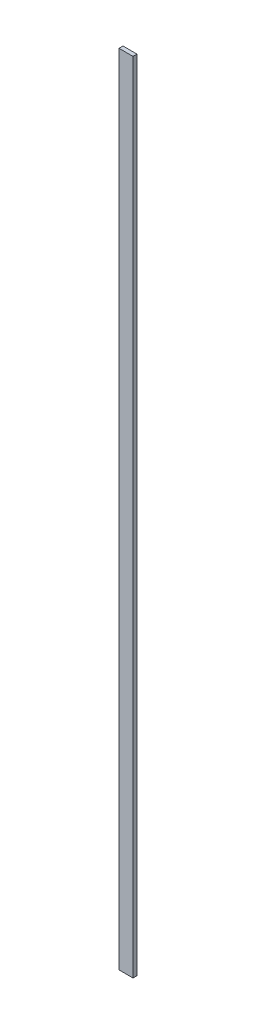
ISO-10303-21;
HEADER;
FILE_DESCRIPTION(('STEP AP214'),'2;1');
FILE_NAME('part.step','',(''),(''),'','','');
FILE_SCHEMA(('AUTOMOTIVE_DESIGN { 1 0 10303 214 1 1 1 1 }'));
ENDSEC;
DATA;
#1=APPLICATION_CONTEXT('core data for automotive mechanical design processes');
#2=APPLICATION_PROTOCOL_DEFINITION('international standard','automotive_design',2000,#1);
#3=PRODUCT_CONTEXT('',#1,'mechanical');
#4=PRODUCT('Part','Part','',(#3));
#5=PRODUCT_RELATED_PRODUCT_CATEGORY('part','',(#4));
#6=PRODUCT_DEFINITION_FORMATION('','',#4);
#7=PRODUCT_DEFINITION_CONTEXT('part definition',#1,'design');
#8=PRODUCT_DEFINITION('design','',#6,#7);
#9=PRODUCT_DEFINITION_SHAPE('','',#8);
#10=(LENGTH_UNIT() NAMED_UNIT(*) SI_UNIT(.MILLI.,.METRE.));
#11=(NAMED_UNIT(*) PLANE_ANGLE_UNIT() SI_UNIT($,.RADIAN.));
#12=(NAMED_UNIT(*) SI_UNIT($,.STERADIAN.) SOLID_ANGLE_UNIT());
#13=UNCERTAINTY_MEASURE_WITH_UNIT(LENGTH_MEASURE(1.E-05),#10,'distance_accuracy_value','');
#14=(GEOMETRIC_REPRESENTATION_CONTEXT(3) GLOBAL_UNCERTAINTY_ASSIGNED_CONTEXT((#13)) GLOBAL_UNIT_ASSIGNED_CONTEXT((#10,
#11,#12)) REPRESENTATION_CONTEXT('',''));
#15=CARTESIAN_POINT('',(0.,0.,0.));
#16=DIRECTION('',(0.,0.,1.));
#17=DIRECTION('',(1.,0.,0.));
#18=AXIS2_PLACEMENT_3D('',#15,#16,#17);
#19=CARTESIAN_POINT('',(-21.7388062871707,33.9181818181818,2.));
#20=DIRECTION('',(1.,0.,0.));
#21=DIRECTION('',(0.,1.,0.));
#22=AXIS2_PLACEMENT_3D('',#19,#20,#21);
#23=PLANE('',#22);
#24=DIRECTION('',(0.,-1.,0.));
#25=VECTOR('',#24,1.);
#26=CARTESIAN_POINT('',(-21.7388062871707,33.9181818181818,0.));
#27=LINE('',#26,#25);
#28=CARTESIAN_POINT('',(-21.7388062871707,33.9181818181818,0.));
#29=VERTEX_POINT('',#28);
#30=CARTESIAN_POINT('',(-21.7388062871707,-366.081818181818,0.));
#31=VERTEX_POINT('',#30);
#32=EDGE_CURVE('E96',#29,#31,#27,.T.);
#33=ORIENTED_EDGE('',*,*,#32,.T.);
#34=DIRECTION('',(0.,0.,-1.));
#35=VECTOR('',#34,1.);
#36=CARTESIAN_POINT('',(-21.7388062871707,-366.081818181818,2.));
#37=LINE('',#36,#35);
#38=CARTESIAN_POINT('',(-21.7388062871707,-366.081818181818,2.));
#39=VERTEX_POINT('',#38);
#40=EDGE_CURVE('E11',#39,#31,#37,.T.);
#41=ORIENTED_EDGE('',*,*,#40,.F.);
#42=DIRECTION('',(0.,-1.,0.));
#43=VECTOR('',#42,1.);
#44=CARTESIAN_POINT('',(-21.7388062871707,33.9181818181818,2.));
#45=LINE('',#44,#43);
#46=CARTESIAN_POINT('',(-21.7388062871707,33.9181818181818,2.));
#47=VERTEX_POINT('',#46);
#48=EDGE_CURVE('E84',#47,#39,#45,.T.);
#49=ORIENTED_EDGE('',*,*,#48,.F.);
#50=DIRECTION('',(0.,0.,-1.));
#51=VECTOR('',#50,1.);
#52=CARTESIAN_POINT('',(-21.7388062871707,33.9181818181818,2.));
#53=LINE('',#52,#51);
#54=EDGE_CURVE('E92',#47,#29,#53,.T.);
#55=ORIENTED_EDGE('',*,*,#54,.T.);
#56=EDGE_LOOP('',(#33,#41,#49,#55));
#57=FACE_BOUND('',#56,.T.);
#58=ADVANCED_FACE('F33',(#57),#23,.F.);
#59=CARTESIAN_POINT('',(-21.7388062871707,-366.081818181818,2.));
#60=DIRECTION('',(0.,1.,0.));
#61=DIRECTION('',(0.,0.,1.));
#62=AXIS2_PLACEMENT_3D('',#59,#60,#61);
#63=PLANE('',#62);
#64=DIRECTION('',(1.,0.,0.));
#65=VECTOR('',#64,1.);
#66=CARTESIAN_POINT('',(-21.7388062871707,-366.081818181818,0.));
#67=LINE('',#66,#65);
#68=CARTESIAN_POINT('',(-14.7388062871707,-366.081818181818,0.));
#69=VERTEX_POINT('',#68);
#70=EDGE_CURVE('E88',#31,#69,#67,.T.);
#71=ORIENTED_EDGE('',*,*,#70,.T.);
#72=DIRECTION('',(0.,0.,-1.));
#73=VECTOR('',#72,1.);
#74=CARTESIAN_POINT('',(-14.7388062871707,-366.081818181818,2.));
#75=LINE('',#74,#73);
#76=CARTESIAN_POINT('',(-14.7388062871707,-366.081818181818,2.));
#77=VERTEX_POINT('',#76);
#78=EDGE_CURVE('E41',#77,#69,#75,.T.);
#79=ORIENTED_EDGE('',*,*,#78,.F.);
#80=DIRECTION('',(1.,0.,0.));
#81=VECTOR('',#80,1.);
#82=CARTESIAN_POINT('',(-21.7388062871707,-366.081818181818,2.));
#83=LINE('',#82,#81);
#84=EDGE_CURVE('E79',#39,#77,#83,.T.);
#85=ORIENTED_EDGE('',*,*,#84,.F.);
#86=ORIENTED_EDGE('',*,*,#40,.T.);
#87=EDGE_LOOP('',(#71,#79,#85,#86));
#88=FACE_BOUND('',#87,.T.);
#89=ADVANCED_FACE('F87',(#88),#63,.F.);
#90=CARTESIAN_POINT('',(-14.7388062871707,33.9181818181818,2.));
#91=DIRECTION('',(-1.,0.,0.));
#92=DIRECTION('',(0.,-1.,0.));
#93=AXIS2_PLACEMENT_3D('',#90,#91,#92);
#94=PLANE('',#93);
#95=DIRECTION('',(0.,1.,0.));
#96=VECTOR('',#95,1.);
#97=CARTESIAN_POINT('',(-14.7388062871707,33.9181818181818,0.));
#98=LINE('',#97,#96);
#99=CARTESIAN_POINT('',(-14.7388062871707,33.9181818181818,0.));
#100=VERTEX_POINT('',#99);
#101=EDGE_CURVE('E66',#69,#100,#98,.T.);
#102=ORIENTED_EDGE('',*,*,#101,.T.);
#103=DIRECTION('',(0.,0.,-1.));
#104=VECTOR('',#103,1.);
#105=CARTESIAN_POINT('',(-14.7388062871707,33.9181818181818,2.));
#106=LINE('',#105,#104);
#107=CARTESIAN_POINT('',(-14.7388062871707,33.9181818181818,2.));
#108=VERTEX_POINT('',#107);
#109=EDGE_CURVE('E89',#108,#100,#106,.T.);
#110=ORIENTED_EDGE('',*,*,#109,.F.);
#111=DIRECTION('',(0.,1.,0.));
#112=VECTOR('',#111,1.);
#113=CARTESIAN_POINT('',(-14.7388062871707,33.9181818181818,2.));
#114=LINE('',#113,#112);
#115=EDGE_CURVE('E82',#77,#108,#114,.T.);
#116=ORIENTED_EDGE('',*,*,#115,.F.);
#117=ORIENTED_EDGE('',*,*,#78,.T.);
#118=EDGE_LOOP('',(#102,#110,#116,#117));
#119=FACE_BOUND('',#118,.T.);
#120=ADVANCED_FACE('F90',(#119),#94,.F.);
#121=CARTESIAN_POINT('',(-21.7388062871707,33.9181818181818,2.));
#122=DIRECTION('',(0.,-1.,0.));
#123=DIRECTION('',(0.,0.,-1.));
#124=AXIS2_PLACEMENT_3D('',#121,#122,#123);
#125=PLANE('',#124);
#126=DIRECTION('',(-1.,0.,0.));
#127=VECTOR('',#126,1.);
#128=CARTESIAN_POINT('',(-21.7388062871707,33.9181818181818,0.));
#129=LINE('',#128,#127);
#130=EDGE_CURVE('E72',#100,#29,#129,.T.);
#131=ORIENTED_EDGE('',*,*,#130,.T.);
#132=ORIENTED_EDGE('',*,*,#54,.F.);
#133=DIRECTION('',(-1.,0.,0.));
#134=VECTOR('',#133,1.);
#135=CARTESIAN_POINT('',(-21.7388062871707,33.9181818181818,2.));
#136=LINE('',#135,#134);
#137=EDGE_CURVE('E49',#108,#47,#136,.T.);
#138=ORIENTED_EDGE('',*,*,#137,.F.);
#139=ORIENTED_EDGE('',*,*,#109,.T.);
#140=EDGE_LOOP('',(#131,#132,#138,#139));
#141=FACE_BOUND('',#140,.T.);
#142=ADVANCED_FACE('F103',(#141),#125,.F.);
#143=CARTESIAN_POINT('',(0.,0.,2.));
#144=DIRECTION('',(0.,0.,1.));
#145=DIRECTION('',(1.,0.,0.));
#146=AXIS2_PLACEMENT_3D('',#143,#144,#145);
#147=PLANE('',#146);
#148=ORIENTED_EDGE('',*,*,#48,.T.);
#149=ORIENTED_EDGE('',*,*,#84,.T.);
#150=ORIENTED_EDGE('',*,*,#115,.T.);
#151=ORIENTED_EDGE('',*,*,#137,.T.);
#152=EDGE_LOOP('',(#148,#149,#150,#151));
#153=FACE_BOUND('',#152,.T.);
#154=ADVANCED_FACE('F80',(#153),#147,.T.);
#155=CARTESIAN_POINT('',(0.,0.,0.));
#156=DIRECTION('',(0.,0.,1.));
#157=DIRECTION('',(1.,0.,0.));
#158=AXIS2_PLACEMENT_3D('',#155,#156,#157);
#159=PLANE('',#158);
#160=ORIENTED_EDGE('',*,*,#32,.F.);
#161=ORIENTED_EDGE('',*,*,#130,.F.);
#162=ORIENTED_EDGE('',*,*,#101,.F.);
#163=ORIENTED_EDGE('',*,*,#70,.F.);
#164=EDGE_LOOP('',(#160,#161,#162,#163));
#165=FACE_BOUND('',#164,.T.);
#166=ADVANCED_FACE('F106',(#165),#159,.F.);
#167=CLOSED_SHELL('',(#58,#89,#120,#142,#154,#166));
#168=MANIFOLD_SOLID_BREP('B2',#167);
#169=ADVANCED_BREP_SHAPE_REPRESENTATION('',(#18,#168),#14);
#170=SHAPE_DEFINITION_REPRESENTATION(#9,#169);
ENDSEC;
END-ISO-10303-21;
